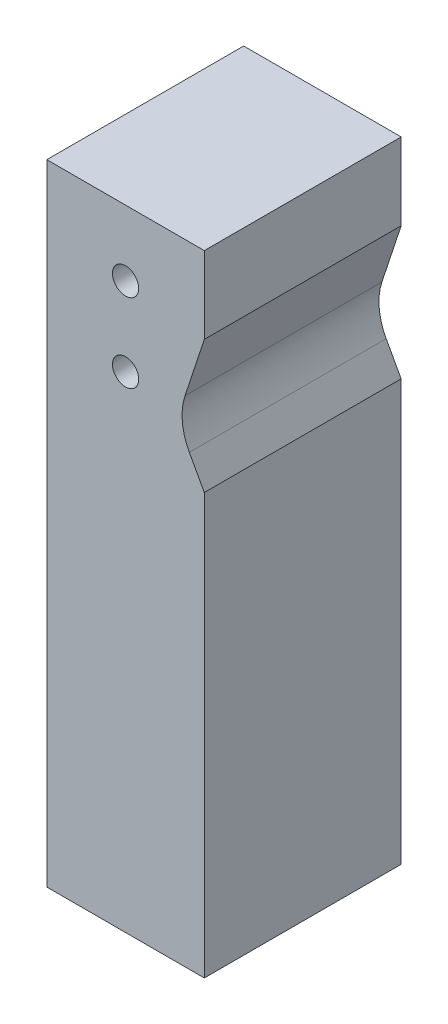
ISO-10303-21;
HEADER;
FILE_DESCRIPTION(('STEP AP214'),'2;1');
FILE_NAME('part.step','',(''),(''),'','','');
FILE_SCHEMA(('AUTOMOTIVE_DESIGN { 1 0 10303 214 1 1 1 1 }'));
ENDSEC;
DATA;
#1=APPLICATION_CONTEXT('core data for automotive mechanical design processes');
#2=APPLICATION_PROTOCOL_DEFINITION('international standard','automotive_design',2000,#1);
#3=PRODUCT_CONTEXT('',#1,'mechanical');
#4=PRODUCT('Part','Part','',(#3));
#5=PRODUCT_RELATED_PRODUCT_CATEGORY('part','',(#4));
#6=PRODUCT_DEFINITION_FORMATION('','',#4);
#7=PRODUCT_DEFINITION_CONTEXT('part definition',#1,'design');
#8=PRODUCT_DEFINITION('design','',#6,#7);
#9=PRODUCT_DEFINITION_SHAPE('','',#8);
#10=(LENGTH_UNIT() NAMED_UNIT(*) SI_UNIT(.MILLI.,.METRE.));
#11=(NAMED_UNIT(*) PLANE_ANGLE_UNIT() SI_UNIT($,.RADIAN.));
#12=(NAMED_UNIT(*) SI_UNIT($,.STERADIAN.) SOLID_ANGLE_UNIT());
#13=UNCERTAINTY_MEASURE_WITH_UNIT(LENGTH_MEASURE(1.E-05),#10,'distance_accuracy_value','');
#14=(GEOMETRIC_REPRESENTATION_CONTEXT(3) GLOBAL_UNCERTAINTY_ASSIGNED_CONTEXT((#13)) GLOBAL_UNIT_ASSIGNED_CONTEXT((#10,
#11,#12)) REPRESENTATION_CONTEXT('',''));
#15=CARTESIAN_POINT('',(0.,0.,0.));
#16=DIRECTION('',(0.,0.,1.));
#17=DIRECTION('',(1.,0.,0.));
#18=AXIS2_PLACEMENT_3D('',#15,#16,#17);
#19=CARTESIAN_POINT('',(9.525,-63.5,23.8125));
#20=DIRECTION('',(-1.,0.,0.));
#21=DIRECTION('',(0.,0.,1.));
#22=AXIS2_PLACEMENT_3D('',#19,#20,#21);
#23=PLANE('',#22);
#24=DIRECTION('',(0.,1.,0.));
#25=VECTOR('',#24,1.);
#26=CARTESIAN_POINT('',(9.525,-63.5,23.8125));
#27=LINE('',#26,#25);
#28=CARTESIAN_POINT('',(9.525,3.39694118877439,23.8125));
#29=VERTEX_POINT('',#28);
#30=CARTESIAN_POINT('',(9.525,12.7,23.8125));
#31=VERTEX_POINT('',#30);
#32=EDGE_CURVE('E84',#29,#31,#27,.T.);
#33=ORIENTED_EDGE('',*,*,#32,.F.);
#34=DIRECTION('',(0.,0.,1.));
#35=VECTOR('',#34,1.);
#36=CARTESIAN_POINT('',(9.525,3.39694118877439,-0.001000000000001));
#37=LINE('',#36,#35);
#38=CARTESIAN_POINT('',(9.525,3.39694118877436,0.));
#39=VERTEX_POINT('',#38);
#40=EDGE_CURVE('E111',#39,#29,#37,.T.);
#41=ORIENTED_EDGE('',*,*,#40,.F.);
#42=DIRECTION('',(0.,1.,0.));
#43=VECTOR('',#42,1.);
#44=CARTESIAN_POINT('',(9.525,-63.5,0.));
#45=LINE('',#44,#43);
#46=CARTESIAN_POINT('',(9.525,12.7,0.));
#47=VERTEX_POINT('',#46);
#48=EDGE_CURVE('E121',#39,#47,#45,.T.);
#49=ORIENTED_EDGE('',*,*,#48,.T.);
#50=DIRECTION('',(0.,0.,-1.));
#51=VECTOR('',#50,1.);
#52=CARTESIAN_POINT('',(9.525,12.7,23.8125));
#53=LINE('',#52,#51);
#54=EDGE_CURVE('E11',#31,#47,#53,.T.);
#55=ORIENTED_EDGE('',*,*,#54,.F.);
#56=EDGE_LOOP('',(#33,#41,#49,#55));
#57=FACE_BOUND('',#56,.T.);
#58=ADVANCED_FACE('F32',(#57),#23,.F.);
#59=CARTESIAN_POINT('',(0.,0.,23.8125));
#60=DIRECTION('',(0.,0.,-1.));
#61=DIRECTION('',(-1.,0.,0.));
#62=AXIS2_PLACEMENT_3D('',#59,#60,#61);
#63=PLANE('',#62);
#64=CARTESIAN_POINT('',(13.9774186979601,-5.90338449995695,23.8125));
#65=DIRECTION('',(0.,0.,1.));
#66=DIRECTION('',(1.,0.,0.));
#67=AXIS2_PLACEMENT_3D('',#64,#65,#66);
#68=CIRCLE('',#67,7.14374999999999);
#69=CARTESIAN_POINT('',(7.19383824508585,-3.66369695436438,23.8125));
#70=VERTEX_POINT('',#69);
#71=CARTESIAN_POINT('',(7.71369005351437,-9.3383324662659,23.8125));
#72=VERTEX_POINT('',#71);
#73=EDGE_CURVE('E116',#70,#72,#68,.T.);
#74=ORIENTED_EDGE('',*,*,#73,.F.);
#75=DIRECTION('',(-0.313517066749615,-0.949582565581697,0.));
#76=VECTOR('',#75,1.);
#77=CARTESIAN_POINT('',(7.19383824508585,-3.66369695436438,23.8125));
#78=LINE('',#77,#76);
#79=EDGE_CURVE('E176',#29,#70,#78,.T.);
#80=ORIENTED_EDGE('',*,*,#79,.F.);
#81=ORIENTED_EDGE('',*,*,#32,.T.);
#82=DIRECTION('',(-1.,0.,0.));
#83=VECTOR('',#82,1.);
#84=CARTESIAN_POINT('',(-9.525,12.7,23.8125));
#85=LINE('',#84,#83);
#86=CARTESIAN_POINT('',(-9.525,12.7,23.8125));
#87=VERTEX_POINT('',#86);
#88=EDGE_CURVE('E161',#31,#87,#85,.T.);
#89=ORIENTED_EDGE('',*,*,#88,.T.);
#90=DIRECTION('',(0.,-1.,0.));
#91=VECTOR('',#90,1.);
#92=CARTESIAN_POINT('',(-9.525,-63.5,23.8125));
#93=LINE('',#92,#91);
#94=CARTESIAN_POINT('',(-9.525,-63.5,23.8125));
#95=VERTEX_POINT('',#94);
#96=EDGE_CURVE('E152',#87,#95,#93,.T.);
#97=ORIENTED_EDGE('',*,*,#96,.T.);
#98=DIRECTION('',(1.,0.,0.));
#99=VECTOR('',#98,1.);
#100=CARTESIAN_POINT('',(-9.525,-63.5,23.8125));
#101=LINE('',#100,#99);
#102=CARTESIAN_POINT('',(9.525,-63.5,23.8125));
#103=VERTEX_POINT('',#102);
#104=EDGE_CURVE('E56',#95,#103,#101,.T.);
#105=ORIENTED_EDGE('',*,*,#104,.T.);
#106=CARTESIAN_POINT('',(9.525,-12.6413094275044,23.8125));
#107=VERTEX_POINT('',#106);
#108=EDGE_CURVE('E159',#103,#107,#27,.T.);
#109=ORIENTED_EDGE('',*,*,#108,.T.);
#110=DIRECTION('',(0.480832611206854,-0.876812408671318,0.));
#111=VECTOR('',#110,1.);
#112=CARTESIAN_POINT('',(9.525,-12.6413094275044,23.8125));
#113=LINE('',#112,#111);
#114=EDGE_CURVE('E47',#72,#107,#113,.T.);
#115=ORIENTED_EDGE('',*,*,#114,.F.);
#116=EDGE_LOOP('',(#74,#80,#81,#89,#97,#105,#109,#115));
#117=FACE_BOUND('',#116,.T.);
#118=CARTESIAN_POINT('',(0.,4.7625,23.8125));
#119=DIRECTION('',(0.,0.,1.));
#120=DIRECTION('',(1.,0.,0.));
#121=AXIS2_PLACEMENT_3D('',#118,#119,#120);
#122=CIRCLE('',#121,1.5875);
#123=CARTESIAN_POINT('',(1.5875,4.7625,23.8125));
#124=VERTEX_POINT('',#123);
#125=EDGE_CURVE('E130',#124,#124,#122,.T.);
#126=ORIENTED_EDGE('',*,*,#125,.F.);
#127=EDGE_LOOP('',(#126));
#128=FACE_BOUND('',#127,.T.);
#129=CARTESIAN_POINT('',(0.,-4.7625,23.8125));
#130=DIRECTION('',(0.,0.,1.));
#131=DIRECTION('',(1.,0.,0.));
#132=AXIS2_PLACEMENT_3D('',#129,#130,#131);
#133=CIRCLE('',#132,1.5875);
#134=CARTESIAN_POINT('',(1.5875,-4.7625,23.8125));
#135=VERTEX_POINT('',#134);
#136=EDGE_CURVE('E166',#135,#135,#133,.T.);
#137=ORIENTED_EDGE('',*,*,#136,.F.);
#138=EDGE_LOOP('',(#137));
#139=FACE_BOUND('',#138,.T.);
#140=ADVANCED_FACE('F196',(#117,#128,#139),#63,.F.);
#141=CARTESIAN_POINT('',(0.,0.,0.));
#142=DIRECTION('',(0.,0.,-1.));
#143=DIRECTION('',(-1.,0.,0.));
#144=AXIS2_PLACEMENT_3D('',#141,#142,#143);
#145=PLANE('',#144);
#146=DIRECTION('',(-0.313517066749615,-0.949582565581697,0.));
#147=VECTOR('',#146,1.);
#148=CARTESIAN_POINT('',(7.19383824508585,-3.66369695436438,0.));
#149=LINE('',#148,#147);
#150=CARTESIAN_POINT('',(7.19383824508585,-3.66369695436438,0.));
#151=VERTEX_POINT('',#150);
#152=EDGE_CURVE('E107',#39,#151,#149,.T.);
#153=ORIENTED_EDGE('',*,*,#152,.T.);
#154=CARTESIAN_POINT('',(13.9774186979601,-5.90338449995695,0.));
#155=DIRECTION('',(0.,0.,-1.));
#156=DIRECTION('',(-1.,0.,0.));
#157=AXIS2_PLACEMENT_3D('',#154,#155,#156);
#158=CIRCLE('',#157,7.14374999999999);
#159=CARTESIAN_POINT('',(7.71369005351437,-9.3383324662659,0.));
#160=VERTEX_POINT('',#159);
#161=EDGE_CURVE('E117',#151,#160,#158,.F.);
#162=ORIENTED_EDGE('',*,*,#161,.T.);
#163=DIRECTION('',(0.480832611206854,-0.876812408671318,0.));
#164=VECTOR('',#163,1.);
#165=CARTESIAN_POINT('',(9.525,-12.6413094275044,0.));
#166=LINE('',#165,#164);
#167=CARTESIAN_POINT('',(9.525,-12.6413094275044,0.));
#168=VERTEX_POINT('',#167);
#169=EDGE_CURVE('E156',#160,#168,#166,.T.);
#170=ORIENTED_EDGE('',*,*,#169,.T.);
#171=CARTESIAN_POINT('',(9.525,-63.5,0.));
#172=VERTEX_POINT('',#171);
#173=EDGE_CURVE('E129',#172,#168,#45,.T.);
#174=ORIENTED_EDGE('',*,*,#173,.F.);
#175=DIRECTION('',(1.,0.,0.));
#176=VECTOR('',#175,1.);
#177=CARTESIAN_POINT('',(-9.525,-63.5,0.));
#178=LINE('',#177,#176);
#179=CARTESIAN_POINT('',(-9.525,-63.5,0.));
#180=VERTEX_POINT('',#179);
#181=EDGE_CURVE('E77',#180,#172,#178,.T.);
#182=ORIENTED_EDGE('',*,*,#181,.F.);
#183=DIRECTION('',(0.,-1.,0.));
#184=VECTOR('',#183,1.);
#185=CARTESIAN_POINT('',(-9.525,-63.5,0.));
#186=LINE('',#185,#184);
#187=CARTESIAN_POINT('',(-9.525,12.7,0.));
#188=VERTEX_POINT('',#187);
#189=EDGE_CURVE('E140',#188,#180,#186,.T.);
#190=ORIENTED_EDGE('',*,*,#189,.F.);
#191=DIRECTION('',(-1.,0.,0.));
#192=VECTOR('',#191,1.);
#193=CARTESIAN_POINT('',(-9.525,12.7,0.));
#194=LINE('',#193,#192);
#195=EDGE_CURVE('E128',#47,#188,#194,.T.);
#196=ORIENTED_EDGE('',*,*,#195,.F.);
#197=ORIENTED_EDGE('',*,*,#48,.F.);
#198=EDGE_LOOP('',(#153,#162,#170,#174,#182,#190,#196,#197));
#199=FACE_BOUND('',#198,.T.);
#200=CARTESIAN_POINT('',(0.,4.7625,0.));
#201=DIRECTION('',(0.,0.,1.));
#202=DIRECTION('',(1.,0.,0.));
#203=AXIS2_PLACEMENT_3D('',#200,#201,#202);
#204=CIRCLE('',#203,1.5875);
#205=CARTESIAN_POINT('',(1.5875,4.7625,0.));
#206=VERTEX_POINT('',#205);
#207=EDGE_CURVE('E134',#206,#206,#204,.T.);
#208=ORIENTED_EDGE('',*,*,#207,.T.);
#209=EDGE_LOOP('',(#208));
#210=FACE_BOUND('',#209,.T.);
#211=CARTESIAN_POINT('',(0.,-4.7625,0.));
#212=DIRECTION('',(0.,0.,1.));
#213=DIRECTION('',(1.,0.,0.));
#214=AXIS2_PLACEMENT_3D('',#211,#212,#213);
#215=CIRCLE('',#214,1.5875);
#216=CARTESIAN_POINT('',(1.5875,-4.7625,0.));
#217=VERTEX_POINT('',#216);
#218=EDGE_CURVE('E168',#217,#217,#215,.T.);
#219=ORIENTED_EDGE('',*,*,#218,.T.);
#220=EDGE_LOOP('',(#219));
#221=FACE_BOUND('',#220,.T.);
#222=ADVANCED_FACE('F125',(#199,#210,#221),#145,.T.);
#223=ORIENTED_EDGE('',*,*,#173,.T.);
#224=DIRECTION('',(0.,0.,1.));
#225=VECTOR('',#224,1.);
#226=CARTESIAN_POINT('',(9.525,-12.6413094275044,-0.001000000000001));
#227=LINE('',#226,#225);
#228=EDGE_CURVE('E123',#168,#107,#227,.T.);
#229=ORIENTED_EDGE('',*,*,#228,.T.);
#230=ORIENTED_EDGE('',*,*,#108,.F.);
#231=DIRECTION('',(0.,0.,-1.));
#232=VECTOR('',#231,1.);
#233=CARTESIAN_POINT('',(9.525,-63.5,23.8125));
#234=LINE('',#233,#232);
#235=EDGE_CURVE('E143',#103,#172,#234,.T.);
#236=ORIENTED_EDGE('',*,*,#235,.T.);
#237=EDGE_LOOP('',(#223,#229,#230,#236));
#238=FACE_BOUND('',#237,.T.);
#239=ADVANCED_FACE('F34',(#238),#23,.F.);
#240=CARTESIAN_POINT('',(-9.525,12.7,23.8125));
#241=DIRECTION('',(0.,-1.,0.));
#242=DIRECTION('',(0.,0.,-1.));
#243=AXIS2_PLACEMENT_3D('',#240,#241,#242);
#244=PLANE('',#243);
#245=ORIENTED_EDGE('',*,*,#195,.T.);
#246=DIRECTION('',(0.,0.,-1.));
#247=VECTOR('',#246,1.);
#248=CARTESIAN_POINT('',(-9.525,12.7,23.8125));
#249=LINE('',#248,#247);
#250=EDGE_CURVE('E40',#87,#188,#249,.T.);
#251=ORIENTED_EDGE('',*,*,#250,.F.);
#252=ORIENTED_EDGE('',*,*,#88,.F.);
#253=ORIENTED_EDGE('',*,*,#54,.T.);
#254=EDGE_LOOP('',(#245,#251,#252,#253));
#255=FACE_BOUND('',#254,.T.);
#256=ADVANCED_FACE('F202',(#255),#244,.F.);
#257=CARTESIAN_POINT('',(-9.525,-63.5,23.8125));
#258=DIRECTION('',(1.,0.,0.));
#259=DIRECTION('',(0.,0.,-1.));
#260=AXIS2_PLACEMENT_3D('',#257,#258,#259);
#261=PLANE('',#260);
#262=ORIENTED_EDGE('',*,*,#189,.T.);
#263=DIRECTION('',(0.,0.,-1.));
#264=VECTOR('',#263,1.);
#265=CARTESIAN_POINT('',(-9.525,-63.5,23.8125));
#266=LINE('',#265,#264);
#267=EDGE_CURVE('E145',#95,#180,#266,.T.);
#268=ORIENTED_EDGE('',*,*,#267,.F.);
#269=ORIENTED_EDGE('',*,*,#96,.F.);
#270=ORIENTED_EDGE('',*,*,#250,.T.);
#271=EDGE_LOOP('',(#262,#268,#269,#270));
#272=FACE_BOUND('',#271,.T.);
#273=ADVANCED_FACE('F150',(#272),#261,.F.);
#274=CARTESIAN_POINT('',(-9.525,-63.5,23.8125));
#275=DIRECTION('',(0.,1.,0.));
#276=DIRECTION('',(0.,0.,1.));
#277=AXIS2_PLACEMENT_3D('',#274,#275,#276);
#278=PLANE('',#277);
#279=ORIENTED_EDGE('',*,*,#181,.T.);
#280=ORIENTED_EDGE('',*,*,#235,.F.);
#281=ORIENTED_EDGE('',*,*,#104,.F.);
#282=ORIENTED_EDGE('',*,*,#267,.T.);
#283=EDGE_LOOP('',(#279,#280,#281,#282));
#284=FACE_BOUND('',#283,.T.);
#285=ADVANCED_FACE('F160',(#284),#278,.F.);
#286=CARTESIAN_POINT('',(0.,4.7625,23.8125));
#287=DIRECTION('',(0.,0.,-1.));
#288=DIRECTION('',(-1.,0.,0.));
#289=AXIS2_PLACEMENT_3D('',#286,#287,#288);
#290=CYLINDRICAL_SURFACE('',#289,1.5875);
#291=ORIENTED_EDGE('',*,*,#125,.T.);
#292=EDGE_LOOP('',(#291));
#293=FACE_BOUND('',#292,.T.);
#294=ORIENTED_EDGE('',*,*,#207,.F.);
#295=EDGE_LOOP('',(#294));
#296=FACE_BOUND('',#295,.T.);
#297=ADVANCED_FACE('F214',(#293,#296),#290,.F.);
#298=CARTESIAN_POINT('',(0.,-4.7625,23.8125));
#299=DIRECTION('',(0.,0.,-1.));
#300=DIRECTION('',(-1.,0.,0.));
#301=AXIS2_PLACEMENT_3D('',#298,#299,#300);
#302=CYLINDRICAL_SURFACE('',#301,1.5875);
#303=ORIENTED_EDGE('',*,*,#136,.T.);
#304=EDGE_LOOP('',(#303));
#305=FACE_BOUND('',#304,.T.);
#306=ORIENTED_EDGE('',*,*,#218,.F.);
#307=EDGE_LOOP('',(#306));
#308=FACE_BOUND('',#307,.T.);
#309=ADVANCED_FACE('F230',(#305,#308),#302,.F.);
#310=CARTESIAN_POINT('',(13.9774186979601,-5.90338449995695,-0.001000000000001));
#311=DIRECTION('',(0.,0.,1.));
#312=DIRECTION('',(1.,0.,0.));
#313=AXIS2_PLACEMENT_3D('',#310,#311,#312);
#314=CYLINDRICAL_SURFACE('',#313,7.14374999999999);
#315=DIRECTION('',(0.,0.,1.));
#316=VECTOR('',#315,1.);
#317=CARTESIAN_POINT('',(7.19383824508585,-3.66369695436438,-0.001000000000001));
#318=LINE('',#317,#316);
#319=EDGE_CURVE('E112',#151,#70,#318,.T.);
#320=ORIENTED_EDGE('',*,*,#319,.T.);
#321=ORIENTED_EDGE('',*,*,#73,.T.);
#322=DIRECTION('',(0.,0.,1.));
#323=VECTOR('',#322,1.);
#324=CARTESIAN_POINT('',(7.71369005351437,-9.3383324662659,-0.001000000000001));
#325=LINE('',#324,#323);
#326=EDGE_CURVE('E174',#160,#72,#325,.T.);
#327=ORIENTED_EDGE('',*,*,#326,.F.);
#328=ORIENTED_EDGE('',*,*,#161,.F.);
#329=EDGE_LOOP('',(#320,#321,#327,#328));
#330=FACE_BOUND('',#329,.T.);
#331=ADVANCED_FACE('F185',(#330),#314,.F.);
#332=CARTESIAN_POINT('',(7.19383824508585,-3.66369695436438,-0.001000000000001));
#333=DIRECTION('',(-0.949582565581697,0.313517066749615,0.));
#334=DIRECTION('',(-0.313517066749615,-0.949582565581697,0.));
#335=AXIS2_PLACEMENT_3D('',#332,#333,#334);
#336=PLANE('',#335);
#337=ORIENTED_EDGE('',*,*,#40,.T.);
#338=ORIENTED_EDGE('',*,*,#79,.T.);
#339=ORIENTED_EDGE('',*,*,#319,.F.);
#340=ORIENTED_EDGE('',*,*,#152,.F.);
#341=EDGE_LOOP('',(#337,#338,#339,#340));
#342=FACE_BOUND('',#341,.T.);
#343=ADVANCED_FACE('F109',(#342),#336,.F.);
#344=CARTESIAN_POINT('',(9.525,-12.6413094275044,-0.001000000000001));
#345=DIRECTION('',(-0.876812408671318,-0.480832611206854,0.));
#346=DIRECTION('',(0.480832611206854,-0.876812408671318,0.));
#347=AXIS2_PLACEMENT_3D('',#344,#345,#346);
#348=PLANE('',#347);
#349=ORIENTED_EDGE('',*,*,#326,.T.);
#350=ORIENTED_EDGE('',*,*,#114,.T.);
#351=ORIENTED_EDGE('',*,*,#228,.F.);
#352=ORIENTED_EDGE('',*,*,#169,.F.);
#353=EDGE_LOOP('',(#349,#350,#351,#352));
#354=FACE_BOUND('',#353,.T.);
#355=ADVANCED_FACE('F187',(#354),#348,.F.);
#356=CLOSED_SHELL('',(#58,#140,#222,#239,#256,#273,#285,#297,#309,#331,#343,#355));
#357=MANIFOLD_SOLID_BREP('B2',#356);
#358=ADVANCED_BREP_SHAPE_REPRESENTATION('',(#18,#357),#14);
#359=SHAPE_DEFINITION_REPRESENTATION(#9,#358);
ENDSEC;
END-ISO-10303-21;
